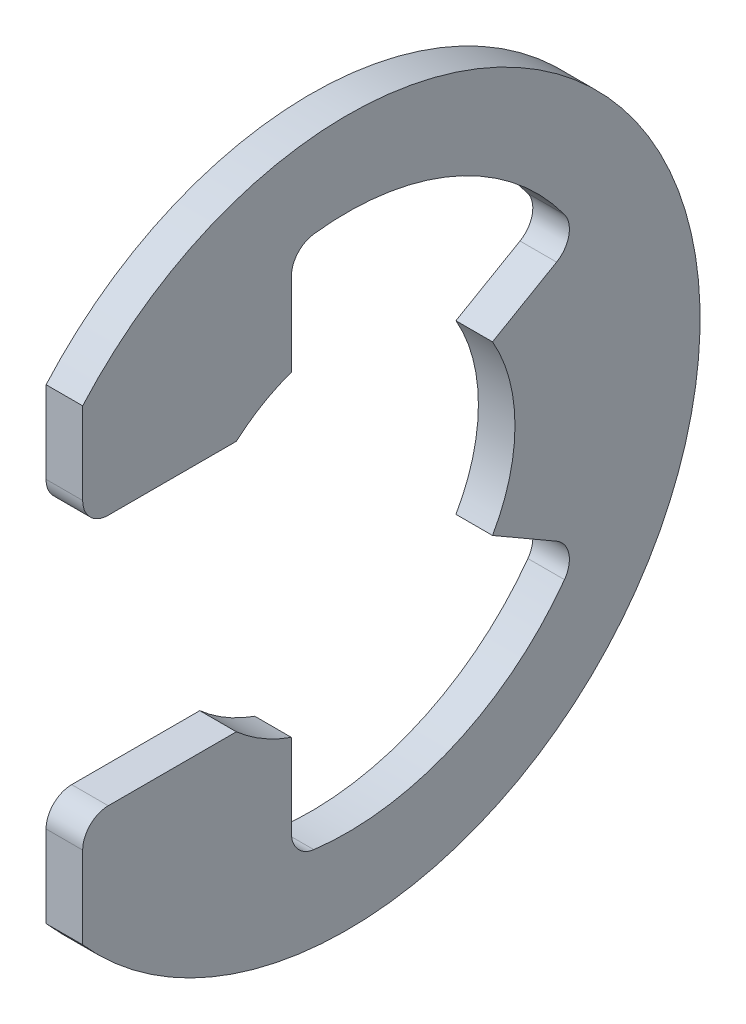
ISO-10303-21;
HEADER;
FILE_DESCRIPTION(('STEP AP214'),'2;1');
FILE_NAME('part.step','',(''),(''),'','','');
FILE_SCHEMA(('AUTOMOTIVE_DESIGN { 1 0 10303 214 1 1 1 1 }'));
ENDSEC;
DATA;
#1=APPLICATION_CONTEXT('core data for automotive mechanical design processes');
#2=APPLICATION_PROTOCOL_DEFINITION('international standard','automotive_design',2000,#1);
#3=PRODUCT_CONTEXT('',#1,'mechanical');
#4=PRODUCT('Part','Part','',(#3));
#5=PRODUCT_RELATED_PRODUCT_CATEGORY('part','',(#4));
#6=PRODUCT_DEFINITION_FORMATION('','',#4);
#7=PRODUCT_DEFINITION_CONTEXT('part definition',#1,'design');
#8=PRODUCT_DEFINITION('design','',#6,#7);
#9=PRODUCT_DEFINITION_SHAPE('','',#8);
#10=(LENGTH_UNIT() NAMED_UNIT(*) SI_UNIT(.MILLI.,.METRE.));
#11=(NAMED_UNIT(*) PLANE_ANGLE_UNIT() SI_UNIT($,.RADIAN.));
#12=(NAMED_UNIT(*) SI_UNIT($,.STERADIAN.) SOLID_ANGLE_UNIT());
#13=UNCERTAINTY_MEASURE_WITH_UNIT(LENGTH_MEASURE(1.E-05),#10,'distance_accuracy_value','');
#14=(GEOMETRIC_REPRESENTATION_CONTEXT(3) GLOBAL_UNCERTAINTY_ASSIGNED_CONTEXT((#13)) GLOBAL_UNIT_ASSIGNED_CONTEXT((#10,
#11,#12)) REPRESENTATION_CONTEXT('',''));
#15=CARTESIAN_POINT('',(0.,0.,0.));
#16=DIRECTION('',(0.,0.,1.));
#17=DIRECTION('',(1.,0.,0.));
#18=AXIS2_PLACEMENT_3D('',#15,#16,#17);
#19=CARTESIAN_POINT('',(0.5334,0.,0.));
#20=DIRECTION('',(-1.,0.,0.));
#21=DIRECTION('',(0.,0.,1.));
#22=AXIS2_PLACEMENT_3D('',#19,#20,#21);
#23=CYLINDRICAL_SURFACE('',#22,10.287);
#24=CARTESIAN_POINT('',(-0.5334,0.,0.));
#25=DIRECTION('',(1.,0.,0.));
#26=DIRECTION('',(0.,0.,-1.));
#27=AXIS2_PLACEMENT_3D('',#24,#25,#26);
#28=CIRCLE('',#27,10.287);
#29=CARTESIAN_POINT('',(-0.5334,-6.80421093423036,7.71525));
#30=VERTEX_POINT('',#29);
#31=CARTESIAN_POINT('',(-0.5334,6.80421093423036,7.71525));
#32=VERTEX_POINT('',#31);
#33=EDGE_CURVE('E194',#30,#32,#28,.T.);
#34=ORIENTED_EDGE('',*,*,#33,.T.);
#35=DIRECTION('',(-1.,0.,0.));
#36=VECTOR('',#35,1.);
#37=CARTESIAN_POINT('',(0.5334,6.80421093423036,7.71525));
#38=LINE('',#37,#36);
#39=CARTESIAN_POINT('',(0.5334,6.80421093423036,7.71525));
#40=VERTEX_POINT('',#39);
#41=EDGE_CURVE('E175',#40,#32,#38,.T.);
#42=ORIENTED_EDGE('',*,*,#41,.F.);
#43=CARTESIAN_POINT('',(0.5334,0.,0.));
#44=DIRECTION('',(1.,0.,0.));
#45=DIRECTION('',(0.,0.,-1.));
#46=AXIS2_PLACEMENT_3D('',#43,#44,#45);
#47=CIRCLE('',#46,10.287);
#48=CARTESIAN_POINT('',(0.5334,-6.80421093423036,7.71525));
#49=VERTEX_POINT('',#48);
#50=EDGE_CURVE('E181',#49,#40,#47,.T.);
#51=ORIENTED_EDGE('',*,*,#50,.F.);
#52=DIRECTION('',(-1.,0.,0.));
#53=VECTOR('',#52,1.);
#54=CARTESIAN_POINT('',(0.5334,-6.80421093423036,7.71525));
#55=LINE('',#54,#53);
#56=EDGE_CURVE('E296',#49,#30,#55,.T.);
#57=ORIENTED_EDGE('',*,*,#56,.T.);
#58=EDGE_LOOP('',(#34,#42,#51,#57));
#59=FACE_BOUND('',#58,.T.);
#60=ADVANCED_FACE('F32',(#59),#23,.T.);
#61=CARTESIAN_POINT('',(0.5334,6.80421093423036,7.71525));
#62=DIRECTION('',(0.,0.,-1.));
#63=DIRECTION('',(0.,1.,0.));
#64=AXIS2_PLACEMENT_3D('',#61,#62,#63);
#65=PLANE('',#64);
#66=DIRECTION('',(0.,-1.,0.));
#67=VECTOR('',#66,1.);
#68=CARTESIAN_POINT('',(-0.5334,6.80421093423036,7.71525));
#69=LINE('',#68,#67);
#70=CARTESIAN_POINT('',(-0.5334,4.413885,7.71525));
#71=VERTEX_POINT('',#70);
#72=EDGE_CURVE('E298',#32,#71,#69,.T.);
#73=ORIENTED_EDGE('',*,*,#72,.T.);
#74=DIRECTION('',(-1.,0.,0.));
#75=VECTOR('',#74,1.);
#76=CARTESIAN_POINT('',(0.5334,4.413885,7.71525));
#77=LINE('',#76,#75);
#78=CARTESIAN_POINT('',(0.5334,4.413885,7.71525));
#79=VERTEX_POINT('',#78);
#80=EDGE_CURVE('E178',#71,#79,#77,.F.);
#81=ORIENTED_EDGE('',*,*,#80,.T.);
#82=DIRECTION('',(0.,-1.,0.));
#83=VECTOR('',#82,1.);
#84=CARTESIAN_POINT('',(0.5334,6.80421093423036,7.71525));
#85=LINE('',#84,#83);
#86=EDGE_CURVE('E170',#40,#79,#85,.T.);
#87=ORIENTED_EDGE('',*,*,#86,.F.);
#88=ORIENTED_EDGE('',*,*,#41,.T.);
#89=EDGE_LOOP('',(#73,#81,#87,#88));
#90=FACE_BOUND('',#89,.T.);
#91=ADVANCED_FACE('F173',(#90),#65,.F.);
#92=CARTESIAN_POINT('',(0.5334,3.667125,3.23410025886258));
#93=DIRECTION('',(0.,1.,0.));
#94=DIRECTION('',(0.,0.,1.));
#95=AXIS2_PLACEMENT_3D('',#92,#93,#94);
#96=PLANE('',#95);
#97=DIRECTION('',(0.,0.,-1.));
#98=VECTOR('',#97,1.);
#99=CARTESIAN_POINT('',(0.5334,3.667125,3.23410025886258));
#100=LINE('',#99,#98);
#101=CARTESIAN_POINT('',(0.5334,3.667125,6.96849));
#102=VERTEX_POINT('',#101);
#103=CARTESIAN_POINT('',(0.5334,3.667125,3.23410025886258));
#104=VERTEX_POINT('',#103);
#105=EDGE_CURVE('E180',#102,#104,#100,.T.);
#106=ORIENTED_EDGE('',*,*,#105,.F.);
#107=DIRECTION('',(-1.,0.,0.));
#108=VECTOR('',#107,1.);
#109=CARTESIAN_POINT('',(0.5334,3.667125,6.96849));
#110=LINE('',#109,#108);
#111=CARTESIAN_POINT('',(-0.5334,3.667125,6.96849));
#112=VERTEX_POINT('',#111);
#113=EDGE_CURVE('E222',#102,#112,#110,.T.);
#114=ORIENTED_EDGE('',*,*,#113,.T.);
#115=DIRECTION('',(0.,0.,-1.));
#116=VECTOR('',#115,1.);
#117=CARTESIAN_POINT('',(-0.5334,3.667125,3.23410025886258));
#118=LINE('',#117,#116);
#119=CARTESIAN_POINT('',(-0.5334,3.667125,3.23410025886258));
#120=VERTEX_POINT('',#119);
#121=EDGE_CURVE('E300',#112,#120,#118,.T.);
#122=ORIENTED_EDGE('',*,*,#121,.T.);
#123=DIRECTION('',(-1.,0.,0.));
#124=VECTOR('',#123,1.);
#125=CARTESIAN_POINT('',(0.5334,3.667125,3.23410025886258));
#126=LINE('',#125,#124);
#127=EDGE_CURVE('E196',#104,#120,#126,.T.);
#128=ORIENTED_EDGE('',*,*,#127,.F.);
#129=EDGE_LOOP('',(#106,#114,#122,#128));
#130=FACE_BOUND('',#129,.T.);
#131=ADVANCED_FACE('F354',(#130),#96,.F.);
#132=CARTESIAN_POINT('',(0.5334,0.,0.));
#133=DIRECTION('',(-1.,0.,0.));
#134=DIRECTION('',(0.,0.,1.));
#135=AXIS2_PLACEMENT_3D('',#132,#133,#134);
#136=CYLINDRICAL_SURFACE('',#135,4.8895);
#137=CARTESIAN_POINT('',(-0.5334,0.,0.));
#138=DIRECTION('',(-1.,0.,0.));
#139=DIRECTION('',(0.,0.,1.));
#140=AXIS2_PLACEMENT_3D('',#137,#138,#139);
#141=CIRCLE('',#140,4.8895);
#142=CARTESIAN_POINT('',(-0.5334,4.6098648088155,1.62983333333333));
#143=VERTEX_POINT('',#142);
#144=EDGE_CURVE('E302',#120,#143,#141,.T.);
#145=ORIENTED_EDGE('',*,*,#144,.T.);
#146=DIRECTION('',(-1.,0.,0.));
#147=VECTOR('',#146,1.);
#148=CARTESIAN_POINT('',(0.5334,4.6098648088155,1.62983333333333));
#149=LINE('',#148,#147);
#150=CARTESIAN_POINT('',(0.5334,4.6098648088155,1.62983333333333));
#151=VERTEX_POINT('',#150);
#152=EDGE_CURVE('E202',#151,#143,#149,.T.);
#153=ORIENTED_EDGE('',*,*,#152,.F.);
#154=CARTESIAN_POINT('',(0.5334,0.,0.));
#155=DIRECTION('',(-1.,0.,0.));
#156=DIRECTION('',(0.,0.,1.));
#157=AXIS2_PLACEMENT_3D('',#154,#155,#156);
#158=CIRCLE('',#157,4.8895);
#159=EDGE_CURVE('E347',#104,#151,#158,.T.);
#160=ORIENTED_EDGE('',*,*,#159,.F.);
#161=ORIENTED_EDGE('',*,*,#127,.T.);
#162=EDGE_LOOP('',(#145,#153,#160,#161));
#163=FACE_BOUND('',#162,.T.);
#164=ADVANCED_FACE('F355',(#163),#136,.F.);
#165=CARTESIAN_POINT('',(0.5334,7.66159498155801,1.62983333333333));
#166=DIRECTION('',(0.,0.,1.));
#167=DIRECTION('',(0.,-1.,0.));
#168=AXIS2_PLACEMENT_3D('',#165,#166,#167);
#169=PLANE('',#168);
#170=DIRECTION('',(0.,1.,0.));
#171=VECTOR('',#170,1.);
#172=CARTESIAN_POINT('',(-0.5334,7.66159498155801,1.62983333333333));
#173=LINE('',#172,#171);
#174=CARTESIAN_POINT('',(-0.5334,7.03103377913734,1.62983333333333));
#175=VERTEX_POINT('',#174);
#176=EDGE_CURVE('E265',#143,#175,#173,.T.);
#177=ORIENTED_EDGE('',*,*,#176,.T.);
#178=DIRECTION('',(1.,0.,0.));
#179=VECTOR('',#178,1.);
#180=CARTESIAN_POINT('',(0.5334,7.03103377913734,1.62983333333333));
#181=LINE('',#180,#179);
#182=CARTESIAN_POINT('',(0.5334,7.03103377913734,1.62983333333333));
#183=VERTEX_POINT('',#182);
#184=EDGE_CURVE('E231',#175,#183,#181,.T.);
#185=ORIENTED_EDGE('',*,*,#184,.T.);
#186=DIRECTION('',(0.,1.,0.));
#187=VECTOR('',#186,1.);
#188=CARTESIAN_POINT('',(0.5334,7.66159498155801,1.62983333333333));
#189=LINE('',#188,#187);
#190=EDGE_CURVE('E281',#151,#183,#189,.T.);
#191=ORIENTED_EDGE('',*,*,#190,.F.);
#192=ORIENTED_EDGE('',*,*,#152,.T.);
#193=EDGE_LOOP('',(#177,#185,#191,#192));
#194=FACE_BOUND('',#193,.T.);
#195=ADVANCED_FACE('F337',(#194),#169,.F.);
#196=CARTESIAN_POINT('',(0.5334,0.,0.));
#197=DIRECTION('',(-1.,0.,0.));
#198=DIRECTION('',(0.,0.,1.));
#199=AXIS2_PLACEMENT_3D('',#196,#197,#198);
#200=CYLINDRICAL_SURFACE('',#199,7.83303225806452);
#201=CARTESIAN_POINT('',(0.5334,0.,0.));
#202=DIRECTION('',(-1.,0.,0.));
#203=DIRECTION('',(0.,0.,-1.));
#204=AXIS2_PLACEMENT_3D('',#201,#202,#203);
#205=CIRCLE('',#204,7.83303225806452);
#206=CARTESIAN_POINT('',(0.5334,7.77197268096027,0.976132676579638));
#207=VERTEX_POINT('',#206);
#208=CARTESIAN_POINT('',(0.5334,4.60957311390225,-6.33310587811927));
#209=VERTEX_POINT('',#208);
#210=EDGE_CURVE('E271',#207,#209,#205,.T.);
#211=ORIENTED_EDGE('',*,*,#210,.F.);
#212=DIRECTION('',(-1.,0.,0.));
#213=VECTOR('',#212,1.);
#214=CARTESIAN_POINT('',(0.5334,7.77197268096027,0.976132676579638));
#215=LINE('',#214,#213);
#216=CARTESIAN_POINT('',(-0.5334,7.77197268096027,0.976132676579638));
#217=VERTEX_POINT('',#216);
#218=EDGE_CURVE('E228',#207,#217,#215,.T.);
#219=ORIENTED_EDGE('',*,*,#218,.T.);
#220=CARTESIAN_POINT('',(-0.5334,0.,0.));
#221=DIRECTION('',(-1.,0.,0.));
#222=DIRECTION('',(0.,0.,-1.));
#223=AXIS2_PLACEMENT_3D('',#220,#221,#222);
#224=CIRCLE('',#223,7.83303225806452);
#225=CARTESIAN_POINT('',(-0.5334,4.60957311390225,-6.33310587811927));
#226=VERTEX_POINT('',#225);
#227=EDGE_CURVE('E254',#217,#226,#224,.T.);
#228=ORIENTED_EDGE('',*,*,#227,.T.);
#229=DIRECTION('',(-1.,0.,0.));
#230=VECTOR('',#229,1.);
#231=CARTESIAN_POINT('',(0.5334,4.60957311390225,-6.33310587811927));
#232=LINE('',#231,#230);
#233=EDGE_CURVE('E226',#226,#209,#232,.F.);
#234=ORIENTED_EDGE('',*,*,#233,.T.);
#235=EDGE_LOOP('',(#211,#219,#228,#234));
#236=FACE_BOUND('',#235,.T.);
#237=ADVANCED_FACE('F262',(#236),#200,.F.);
#238=CARTESIAN_POINT('',(0.5334,2.44475,-4.23443121180401));
#239=DIRECTION('',(0.,-0.866025403784438,-0.500000000000001));
#240=DIRECTION('',(0.,0.500000000000001,-0.866025403784438));
#241=AXIS2_PLACEMENT_3D('',#238,#239,#240);
#242=PLANE('',#241);
#243=DIRECTION('',(0.,-0.500000000000001,0.866025403784438));
#244=VECTOR('',#243,1.);
#245=CARTESIAN_POINT('',(0.5334,2.44475,-4.23443121180401));
#246=LINE('',#245,#244);
#247=CARTESIAN_POINT('',(0.5334,3.5234075842079,-6.10272095162158));
#248=VERTEX_POINT('',#247);
#249=CARTESIAN_POINT('',(0.5334,2.44475000000001,-4.23443121180401));
#250=VERTEX_POINT('',#249);
#251=EDGE_CURVE('E269',#248,#250,#246,.T.);
#252=ORIENTED_EDGE('',*,*,#251,.F.);
#253=DIRECTION('',(1.,0.,0.));
#254=VECTOR('',#253,1.);
#255=CARTESIAN_POINT('',(-0.5334,3.5234075842079,-6.10272095162158));
#256=LINE('',#255,#254);
#257=CARTESIAN_POINT('',(-0.5334,3.5234075842079,-6.10272095162158));
#258=VERTEX_POINT('',#257);
#259=EDGE_CURVE('E235',#248,#258,#256,.F.);
#260=ORIENTED_EDGE('',*,*,#259,.T.);
#261=DIRECTION('',(0.,-0.500000000000001,0.866025403784438));
#262=VECTOR('',#261,1.);
#263=CARTESIAN_POINT('',(-0.5334,2.44475,-4.23443121180401));
#264=LINE('',#263,#262);
#265=CARTESIAN_POINT('',(-0.5334,2.44475000000001,-4.23443121180401));
#266=VERTEX_POINT('',#265);
#267=EDGE_CURVE('E256',#258,#266,#264,.T.);
#268=ORIENTED_EDGE('',*,*,#267,.T.);
#269=DIRECTION('',(-1.,0.,0.));
#270=VECTOR('',#269,1.);
#271=CARTESIAN_POINT('',(0.5334,2.44475000000001,-4.23443121180401));
#272=LINE('',#271,#270);
#273=EDGE_CURVE('E275',#250,#266,#272,.T.);
#274=ORIENTED_EDGE('',*,*,#273,.F.);
#275=EDGE_LOOP('',(#252,#260,#268,#274));
#276=FACE_BOUND('',#275,.T.);
#277=ADVANCED_FACE('F273',(#276),#242,.F.);
#278=CARTESIAN_POINT('',(0.5334,0.,0.));
#279=DIRECTION('',(-1.,0.,0.));
#280=DIRECTION('',(0.,0.,1.));
#281=AXIS2_PLACEMENT_3D('',#278,#279,#280);
#282=CYLINDRICAL_SURFACE('',#281,4.8895);
#283=CARTESIAN_POINT('',(-0.5334,0.,0.));
#284=DIRECTION('',(-1.,0.,0.));
#285=DIRECTION('',(0.,0.,1.));
#286=AXIS2_PLACEMENT_3D('',#283,#284,#285);
#287=CIRCLE('',#286,4.8895);
#288=CARTESIAN_POINT('',(-0.5334,-2.44475,-4.23443121180401));
#289=VERTEX_POINT('',#288);
#290=EDGE_CURVE('E307',#266,#289,#287,.T.);
#291=ORIENTED_EDGE('',*,*,#290,.T.);
#292=DIRECTION('',(-1.,0.,0.));
#293=VECTOR('',#292,1.);
#294=CARTESIAN_POINT('',(0.5334,-2.44475,-4.23443121180401));
#295=LINE('',#294,#293);
#296=CARTESIAN_POINT('',(0.5334,-2.44475,-4.23443121180401));
#297=VERTEX_POINT('',#296);
#298=EDGE_CURVE('E329',#297,#289,#295,.T.);
#299=ORIENTED_EDGE('',*,*,#298,.F.);
#300=CARTESIAN_POINT('',(0.5334,0.,0.));
#301=DIRECTION('',(-1.,0.,0.));
#302=DIRECTION('',(0.,0.,1.));
#303=AXIS2_PLACEMENT_3D('',#300,#301,#302);
#304=CIRCLE('',#303,4.8895);
#305=EDGE_CURVE('E277',#250,#297,#304,.T.);
#306=ORIENTED_EDGE('',*,*,#305,.F.);
#307=ORIENTED_EDGE('',*,*,#273,.T.);
#308=EDGE_LOOP('',(#291,#299,#306,#307));
#309=FACE_BOUND('',#308,.T.);
#310=ADVANCED_FACE('F435',(#309),#282,.F.);
#311=CARTESIAN_POINT('',(0.5334,-2.44475,-4.23443121180401));
#312=DIRECTION('',(0.,0.866025403784438,-0.500000000000001));
#313=DIRECTION('',(0.,0.500000000000001,0.866025403784438));
#314=AXIS2_PLACEMENT_3D('',#311,#312,#313);
#315=PLANE('',#314);
#316=DIRECTION('',(0.,-0.500000000000001,-0.866025403784438));
#317=VECTOR('',#316,1.);
#318=CARTESIAN_POINT('',(-0.5334,-2.44475,-4.23443121180401));
#319=LINE('',#318,#317);
#320=CARTESIAN_POINT('',(-0.5334,-3.5234075842079,-6.10272095162158));
#321=VERTEX_POINT('',#320);
#322=EDGE_CURVE('E309',#289,#321,#319,.T.);
#323=ORIENTED_EDGE('',*,*,#322,.T.);
#324=DIRECTION('',(1.,0.,0.));
#325=VECTOR('',#324,1.);
#326=CARTESIAN_POINT('',(0.5334,-3.5234075842079,-6.10272095162158));
#327=LINE('',#326,#325);
#328=CARTESIAN_POINT('',(0.5334,-3.5234075842079,-6.10272095162158));
#329=VERTEX_POINT('',#328);
#330=EDGE_CURVE('E233',#321,#329,#327,.T.);
#331=ORIENTED_EDGE('',*,*,#330,.T.);
#332=DIRECTION('',(0.,-0.500000000000001,-0.866025403784438));
#333=VECTOR('',#332,1.);
#334=CARTESIAN_POINT('',(0.5334,-2.44475,-4.23443121180401));
#335=LINE('',#334,#333);
#336=EDGE_CURVE('E279',#297,#329,#335,.T.);
#337=ORIENTED_EDGE('',*,*,#336,.F.);
#338=ORIENTED_EDGE('',*,*,#298,.T.);
#339=EDGE_LOOP('',(#323,#331,#337,#338));
#340=FACE_BOUND('',#339,.T.);
#341=ADVANCED_FACE('F432',(#340),#315,.F.);
#342=CARTESIAN_POINT('',(0.5334,0.,0.));
#343=DIRECTION('',(-1.,0.,0.));
#344=DIRECTION('',(0.,0.,1.));
#345=AXIS2_PLACEMENT_3D('',#342,#343,#344);
#346=CYLINDRICAL_SURFACE('',#345,7.83303225806452);
#347=CARTESIAN_POINT('',(-0.5334,0.,0.));
#348=DIRECTION('',(-1.,0.,0.));
#349=DIRECTION('',(0.,0.,-1.));
#350=AXIS2_PLACEMENT_3D('',#347,#348,#349);
#351=CIRCLE('',#350,7.83303225806452);
#352=CARTESIAN_POINT('',(-0.5334,-4.60957311390224,-6.33310587811927));
#353=VERTEX_POINT('',#352);
#354=CARTESIAN_POINT('',(-0.5334,-7.77197268096027,0.976132676579636));
#355=VERTEX_POINT('',#354);
#356=EDGE_CURVE('E312',#353,#355,#351,.T.);
#357=ORIENTED_EDGE('',*,*,#356,.T.);
#358=DIRECTION('',(-1.,0.,0.));
#359=VECTOR('',#358,1.);
#360=CARTESIAN_POINT('',(0.5334,-7.77197268096027,0.976132676579636));
#361=LINE('',#360,#359);
#362=CARTESIAN_POINT('',(0.5334,-7.77197268096027,0.976132676579636));
#363=VERTEX_POINT('',#362);
#364=EDGE_CURVE('E55',#355,#363,#361,.F.);
#365=ORIENTED_EDGE('',*,*,#364,.T.);
#366=CARTESIAN_POINT('',(0.5334,0.,0.));
#367=DIRECTION('',(-1.,0.,0.));
#368=DIRECTION('',(0.,0.,-1.));
#369=AXIS2_PLACEMENT_3D('',#366,#367,#368);
#370=CIRCLE('',#369,7.83303225806452);
#371=CARTESIAN_POINT('',(0.5334,-4.60957311390224,-6.33310587811927));
#372=VERTEX_POINT('',#371);
#373=EDGE_CURVE('E287',#372,#363,#370,.T.);
#374=ORIENTED_EDGE('',*,*,#373,.F.);
#375=DIRECTION('',(-1.,0.,0.));
#376=VECTOR('',#375,1.);
#377=CARTESIAN_POINT('',(0.5334,-4.60957311390224,-6.33310587811927));
#378=LINE('',#377,#376);
#379=EDGE_CURVE('E218',#372,#353,#378,.T.);
#380=ORIENTED_EDGE('',*,*,#379,.T.);
#381=EDGE_LOOP('',(#357,#365,#374,#380));
#382=FACE_BOUND('',#381,.T.);
#383=ADVANCED_FACE('F394',(#382),#346,.F.);
#384=CARTESIAN_POINT('',(0.5334,-4.6098648088155,1.62983333333333));
#385=DIRECTION('',(0.,0.,1.));
#386=DIRECTION('',(0.,-1.,0.));
#387=AXIS2_PLACEMENT_3D('',#384,#385,#386);
#388=PLANE('',#387);
#389=DIRECTION('',(0.,1.,0.));
#390=VECTOR('',#389,1.);
#391=CARTESIAN_POINT('',(0.5334,-4.6098648088155,1.62983333333333));
#392=LINE('',#391,#390);
#393=CARTESIAN_POINT('',(0.5334,-7.03103377913734,1.62983333333333));
#394=VERTEX_POINT('',#393);
#395=CARTESIAN_POINT('',(0.5334,-4.6098648088155,1.62983333333333));
#396=VERTEX_POINT('',#395);
#397=EDGE_CURVE('E289',#394,#396,#392,.T.);
#398=ORIENTED_EDGE('',*,*,#397,.F.);
#399=DIRECTION('',(1.,0.,0.));
#400=VECTOR('',#399,1.);
#401=CARTESIAN_POINT('',(-0.5334,-7.03103377913734,1.62983333333333));
#402=LINE('',#401,#400);
#403=CARTESIAN_POINT('',(-0.5334,-7.03103377913734,1.62983333333333));
#404=VERTEX_POINT('',#403);
#405=EDGE_CURVE('E215',#394,#404,#402,.F.);
#406=ORIENTED_EDGE('',*,*,#405,.T.);
#407=DIRECTION('',(0.,1.,0.));
#408=VECTOR('',#407,1.);
#409=CARTESIAN_POINT('',(-0.5334,-4.6098648088155,1.62983333333333));
#410=LINE('',#409,#408);
#411=CARTESIAN_POINT('',(-0.5334,-4.6098648088155,1.62983333333333));
#412=VERTEX_POINT('',#411);
#413=EDGE_CURVE('E314',#404,#412,#410,.T.);
#414=ORIENTED_EDGE('',*,*,#413,.T.);
#415=DIRECTION('',(-1.,0.,0.));
#416=VECTOR('',#415,1.);
#417=CARTESIAN_POINT('',(0.5334,-4.6098648088155,1.62983333333333));
#418=LINE('',#417,#416);
#419=EDGE_CURVE('E326',#396,#412,#418,.T.);
#420=ORIENTED_EDGE('',*,*,#419,.F.);
#421=EDGE_LOOP('',(#398,#406,#414,#420));
#422=FACE_BOUND('',#421,.T.);
#423=ADVANCED_FACE('F401',(#422),#388,.F.);
#424=CARTESIAN_POINT('',(0.5334,0.,0.));
#425=DIRECTION('',(-1.,0.,0.));
#426=DIRECTION('',(0.,0.,1.));
#427=AXIS2_PLACEMENT_3D('',#424,#425,#426);
#428=CYLINDRICAL_SURFACE('',#427,4.8895);
#429=CARTESIAN_POINT('',(-0.5334,0.,0.));
#430=DIRECTION('',(-1.,0.,0.));
#431=DIRECTION('',(0.,0.,-1.));
#432=AXIS2_PLACEMENT_3D('',#429,#430,#431);
#433=CIRCLE('',#432,4.8895);
#434=CARTESIAN_POINT('',(-0.5334,-3.667125,3.23410025886258));
#435=VERTEX_POINT('',#434);
#436=EDGE_CURVE('E316',#412,#435,#433,.T.);
#437=ORIENTED_EDGE('',*,*,#436,.T.);
#438=DIRECTION('',(-1.,0.,0.));
#439=VECTOR('',#438,1.);
#440=CARTESIAN_POINT('',(0.5334,-3.667125,3.23410025886258));
#441=LINE('',#440,#439);
#442=CARTESIAN_POINT('',(0.5334,-3.667125,3.23410025886258));
#443=VERTEX_POINT('',#442);
#444=EDGE_CURVE('E323',#443,#435,#441,.T.);
#445=ORIENTED_EDGE('',*,*,#444,.F.);
#446=CARTESIAN_POINT('',(0.5334,0.,0.));
#447=DIRECTION('',(-1.,0.,0.));
#448=DIRECTION('',(0.,0.,-1.));
#449=AXIS2_PLACEMENT_3D('',#446,#447,#448);
#450=CIRCLE('',#449,4.8895);
#451=EDGE_CURVE('E291',#396,#443,#450,.T.);
#452=ORIENTED_EDGE('',*,*,#451,.F.);
#453=ORIENTED_EDGE('',*,*,#419,.T.);
#454=EDGE_LOOP('',(#437,#445,#452,#453));
#455=FACE_BOUND('',#454,.T.);
#456=ADVANCED_FACE('F408',(#455),#428,.F.);
#457=CARTESIAN_POINT('',(0.5334,-3.667125,7.71525));
#458=DIRECTION('',(0.,-1.,0.));
#459=DIRECTION('',(0.,0.,-1.));
#460=AXIS2_PLACEMENT_3D('',#457,#458,#459);
#461=PLANE('',#460);
#462=DIRECTION('',(0.,0.,1.));
#463=VECTOR('',#462,1.);
#464=CARTESIAN_POINT('',(-0.5334,-3.667125,7.71525));
#465=LINE('',#464,#463);
#466=CARTESIAN_POINT('',(-0.5334,-3.667125,6.96849));
#467=VERTEX_POINT('',#466);
#468=EDGE_CURVE('E318',#435,#467,#465,.T.);
#469=ORIENTED_EDGE('',*,*,#468,.T.);
#470=DIRECTION('',(-1.,0.,0.));
#471=VECTOR('',#470,1.);
#472=CARTESIAN_POINT('',(0.5334,-3.667125,6.96849));
#473=LINE('',#472,#471);
#474=CARTESIAN_POINT('',(0.5334,-3.667125,6.96849));
#475=VERTEX_POINT('',#474);
#476=EDGE_CURVE('E209',#467,#475,#473,.F.);
#477=ORIENTED_EDGE('',*,*,#476,.T.);
#478=DIRECTION('',(0.,0.,1.));
#479=VECTOR('',#478,1.);
#480=CARTESIAN_POINT('',(0.5334,-3.667125,7.71525));
#481=LINE('',#480,#479);
#482=EDGE_CURVE('E293',#443,#475,#481,.T.);
#483=ORIENTED_EDGE('',*,*,#482,.F.);
#484=ORIENTED_EDGE('',*,*,#444,.T.);
#485=EDGE_LOOP('',(#469,#477,#483,#484));
#486=FACE_BOUND('',#485,.T.);
#487=ADVANCED_FACE('F411',(#486),#461,.F.);
#488=CARTESIAN_POINT('',(0.5334,-6.80421093423036,7.71525));
#489=DIRECTION('',(0.,0.,-1.));
#490=DIRECTION('',(-1.,0.,0.));
#491=AXIS2_PLACEMENT_3D('',#488,#489,#490);
#492=PLANE('',#491);
#493=DIRECTION('',(0.,-1.,0.));
#494=VECTOR('',#493,1.);
#495=CARTESIAN_POINT('',(0.5334,-6.80421093423036,7.71525));
#496=LINE('',#495,#494);
#497=CARTESIAN_POINT('',(0.5334,-4.413885,7.71525));
#498=VERTEX_POINT('',#497);
#499=EDGE_CURVE('E187',#498,#49,#496,.T.);
#500=ORIENTED_EDGE('',*,*,#499,.F.);
#501=DIRECTION('',(-1.,0.,0.));
#502=VECTOR('',#501,1.);
#503=CARTESIAN_POINT('',(0.5334,-4.413885,7.71525));
#504=LINE('',#503,#502);
#505=CARTESIAN_POINT('',(-0.5334,-4.413885,7.71525));
#506=VERTEX_POINT('',#505);
#507=EDGE_CURVE('E195',#498,#506,#504,.T.);
#508=ORIENTED_EDGE('',*,*,#507,.T.);
#509=DIRECTION('',(0.,-1.,0.));
#510=VECTOR('',#509,1.);
#511=CARTESIAN_POINT('',(-0.5334,-6.80421093423036,7.71525));
#512=LINE('',#511,#510);
#513=EDGE_CURVE('E191',#506,#30,#512,.T.);
#514=ORIENTED_EDGE('',*,*,#513,.T.);
#515=ORIENTED_EDGE('',*,*,#56,.F.);
#516=EDGE_LOOP('',(#500,#508,#514,#515));
#517=FACE_BOUND('',#516,.T.);
#518=ADVANCED_FACE('F415',(#517),#492,.F.);
#519=CARTESIAN_POINT('',(0.5334,0.,0.));
#520=DIRECTION('',(1.,0.,0.));
#521=DIRECTION('',(0.,0.,-1.));
#522=AXIS2_PLACEMENT_3D('',#519,#520,#521);
#523=PLANE('',#522);
#524=ORIENTED_EDGE('',*,*,#482,.T.);
#525=CARTESIAN_POINT('',(0.5334,-4.413885,6.96849));
#526=DIRECTION('',(1.,0.,0.));
#527=DIRECTION('',(0.,0.,-1.));
#528=AXIS2_PLACEMENT_3D('',#525,#526,#527);
#529=CIRCLE('',#528,0.74676);
#530=EDGE_CURVE('E213',#475,#498,#529,.T.);
#531=ORIENTED_EDGE('',*,*,#530,.T.);
#532=ORIENTED_EDGE('',*,*,#499,.T.);
#533=ORIENTED_EDGE('',*,*,#50,.T.);
#534=ORIENTED_EDGE('',*,*,#86,.T.);
#535=CARTESIAN_POINT('',(0.5334,4.413885,6.96849));
#536=DIRECTION('',(1.,0.,0.));
#537=DIRECTION('',(0.,0.,-1.));
#538=AXIS2_PLACEMENT_3D('',#535,#536,#537);
#539=CIRCLE('',#538,0.74676);
#540=EDGE_CURVE('E211',#79,#102,#539,.T.);
#541=ORIENTED_EDGE('',*,*,#540,.T.);
#542=ORIENTED_EDGE('',*,*,#105,.T.);
#543=ORIENTED_EDGE('',*,*,#159,.T.);
#544=ORIENTED_EDGE('',*,*,#190,.T.);
#545=CARTESIAN_POINT('',(0.5334,7.03103377913734,0.883073333333332));
#546=DIRECTION('',(1.,0.,0.));
#547=DIRECTION('',(0.,0.,-1.));
#548=AXIS2_PLACEMENT_3D('',#545,#546,#547);
#549=CIRCLE('',#548,0.74676);
#550=EDGE_CURVE('E243',#183,#207,#549,.F.);
#551=ORIENTED_EDGE('',*,*,#550,.T.);
#552=ORIENTED_EDGE('',*,*,#210,.T.);
#553=CARTESIAN_POINT('',(0.5334,4.17012071473797,-5.72934095162158));
#554=DIRECTION('',(1.,0.,0.));
#555=DIRECTION('',(0.,0.,-1.));
#556=AXIS2_PLACEMENT_3D('',#553,#554,#555);
#557=CIRCLE('',#556,0.74676);
#558=EDGE_CURVE('E11',#209,#248,#557,.F.);
#559=ORIENTED_EDGE('',*,*,#558,.T.);
#560=ORIENTED_EDGE('',*,*,#251,.T.);
#561=ORIENTED_EDGE('',*,*,#305,.T.);
#562=ORIENTED_EDGE('',*,*,#336,.T.);
#563=CARTESIAN_POINT('',(0.5334,-4.17012071473797,-5.72934095162158));
#564=DIRECTION('',(1.,0.,0.));
#565=DIRECTION('',(0.,0.,-1.));
#566=AXIS2_PLACEMENT_3D('',#563,#564,#565);
#567=CIRCLE('',#566,0.74676);
#568=EDGE_CURVE('E247',#329,#372,#567,.F.);
#569=ORIENTED_EDGE('',*,*,#568,.T.);
#570=ORIENTED_EDGE('',*,*,#373,.T.);
#571=CARTESIAN_POINT('',(0.5334,-7.03103377913734,0.88307333333333));
#572=DIRECTION('',(1.,0.,0.));
#573=DIRECTION('',(0.,0.,-1.));
#574=AXIS2_PLACEMENT_3D('',#571,#572,#573);
#575=CIRCLE('',#574,0.74676);
#576=EDGE_CURVE('E47',#363,#394,#575,.F.);
#577=ORIENTED_EDGE('',*,*,#576,.T.);
#578=ORIENTED_EDGE('',*,*,#397,.T.);
#579=ORIENTED_EDGE('',*,*,#451,.T.);
#580=EDGE_LOOP('',(#524,#531,#532,#533,#534,#541,#542,#543,#544,#551,#552,#559,#560,#561,#562,
#569,#570,#577,#578,#579));
#581=FACE_BOUND('',#580,.T.);
#582=ADVANCED_FACE('F185',(#581),#523,.T.);
#583=CARTESIAN_POINT('',(-0.5334,0.,0.));
#584=DIRECTION('',(1.,0.,0.));
#585=DIRECTION('',(0.,0.,-1.));
#586=AXIS2_PLACEMENT_3D('',#583,#584,#585);
#587=PLANE('',#586);
#588=ORIENTED_EDGE('',*,*,#513,.F.);
#589=CARTESIAN_POINT('',(-0.5334,-4.413885,6.96849));
#590=DIRECTION('',(1.,0.,0.));
#591=DIRECTION('',(0.,0.,-1.));
#592=AXIS2_PLACEMENT_3D('',#589,#590,#591);
#593=CIRCLE('',#592,0.74676);
#594=EDGE_CURVE('E207',#506,#467,#593,.F.);
#595=ORIENTED_EDGE('',*,*,#594,.T.);
#596=ORIENTED_EDGE('',*,*,#468,.F.);
#597=ORIENTED_EDGE('',*,*,#436,.F.);
#598=ORIENTED_EDGE('',*,*,#413,.F.);
#599=CARTESIAN_POINT('',(-0.5334,-7.03103377913734,0.88307333333333));
#600=DIRECTION('',(1.,0.,0.));
#601=DIRECTION('',(0.,0.,-1.));
#602=AXIS2_PLACEMENT_3D('',#599,#600,#601);
#603=CIRCLE('',#602,0.74676);
#604=EDGE_CURVE('E238',#404,#355,#603,.T.);
#605=ORIENTED_EDGE('',*,*,#604,.T.);
#606=ORIENTED_EDGE('',*,*,#356,.F.);
#607=CARTESIAN_POINT('',(-0.5334,-4.17012071473797,-5.72934095162158));
#608=DIRECTION('',(1.,0.,0.));
#609=DIRECTION('',(0.,0.,-1.));
#610=AXIS2_PLACEMENT_3D('',#607,#608,#609);
#611=CIRCLE('',#610,0.74676);
#612=EDGE_CURVE('E245',#353,#321,#611,.T.);
#613=ORIENTED_EDGE('',*,*,#612,.T.);
#614=ORIENTED_EDGE('',*,*,#322,.F.);
#615=ORIENTED_EDGE('',*,*,#290,.F.);
#616=ORIENTED_EDGE('',*,*,#267,.F.);
#617=CARTESIAN_POINT('',(-0.5334,4.17012071473797,-5.72934095162158));
#618=DIRECTION('',(1.,0.,0.));
#619=DIRECTION('',(0.,0.,-1.));
#620=AXIS2_PLACEMENT_3D('',#617,#618,#619);
#621=CIRCLE('',#620,0.74676);
#622=EDGE_CURVE('E40',#258,#226,#621,.T.);
#623=ORIENTED_EDGE('',*,*,#622,.T.);
#624=ORIENTED_EDGE('',*,*,#227,.F.);
#625=CARTESIAN_POINT('',(-0.5334,7.03103377913734,0.883073333333332));
#626=DIRECTION('',(1.,0.,0.));
#627=DIRECTION('',(0.,0.,-1.));
#628=AXIS2_PLACEMENT_3D('',#625,#626,#627);
#629=CIRCLE('',#628,0.74676);
#630=EDGE_CURVE('E241',#217,#175,#629,.T.);
#631=ORIENTED_EDGE('',*,*,#630,.T.);
#632=ORIENTED_EDGE('',*,*,#176,.F.);
#633=ORIENTED_EDGE('',*,*,#144,.F.);
#634=ORIENTED_EDGE('',*,*,#121,.F.);
#635=CARTESIAN_POINT('',(-0.5334,4.413885,6.96849));
#636=DIRECTION('',(1.,0.,0.));
#637=DIRECTION('',(0.,0.,-1.));
#638=AXIS2_PLACEMENT_3D('',#635,#636,#637);
#639=CIRCLE('',#638,0.74676);
#640=EDGE_CURVE('E199',#112,#71,#639,.F.);
#641=ORIENTED_EDGE('',*,*,#640,.T.);
#642=ORIENTED_EDGE('',*,*,#72,.F.);
#643=ORIENTED_EDGE('',*,*,#33,.F.);
#644=EDGE_LOOP('',(#588,#595,#596,#597,#598,#605,#606,#613,#614,#615,#616,#623,#624,#631,#632,
#633,#634,#641,#642,#643));
#645=FACE_BOUND('',#644,.T.);
#646=ADVANCED_FACE('F253',(#645),#587,.F.);
#647=CARTESIAN_POINT('',(0.5334,-4.413885,6.96849));
#648=DIRECTION('',(-1.,0.,0.));
#649=DIRECTION('',(0.,0.,1.));
#650=AXIS2_PLACEMENT_3D('',#647,#648,#649);
#651=CYLINDRICAL_SURFACE('',#650,0.74676);
#652=ORIENTED_EDGE('',*,*,#530,.F.);
#653=ORIENTED_EDGE('',*,*,#476,.F.);
#654=ORIENTED_EDGE('',*,*,#594,.F.);
#655=ORIENTED_EDGE('',*,*,#507,.F.);
#656=EDGE_LOOP('',(#652,#653,#654,#655));
#657=FACE_BOUND('',#656,.T.);
#658=ADVANCED_FACE('F371',(#657),#651,.T.);
#659=CARTESIAN_POINT('',(0.5334,-7.03103377913734,0.88307333333333));
#660=DIRECTION('',(-1.,0.,0.));
#661=DIRECTION('',(0.,0.,1.));
#662=AXIS2_PLACEMENT_3D('',#659,#660,#661);
#663=CYLINDRICAL_SURFACE('',#662,0.74676);
#664=ORIENTED_EDGE('',*,*,#576,.F.);
#665=ORIENTED_EDGE('',*,*,#364,.F.);
#666=ORIENTED_EDGE('',*,*,#604,.F.);
#667=ORIENTED_EDGE('',*,*,#405,.F.);
#668=EDGE_LOOP('',(#664,#665,#666,#667));
#669=FACE_BOUND('',#668,.T.);
#670=ADVANCED_FACE('F374',(#669),#663,.F.);
#671=CARTESIAN_POINT('',(0.5334,4.413885,6.96849));
#672=DIRECTION('',(-1.,0.,0.));
#673=DIRECTION('',(0.,0.,1.));
#674=AXIS2_PLACEMENT_3D('',#671,#672,#673);
#675=CYLINDRICAL_SURFACE('',#674,0.74676);
#676=ORIENTED_EDGE('',*,*,#540,.F.);
#677=ORIENTED_EDGE('',*,*,#80,.F.);
#678=ORIENTED_EDGE('',*,*,#640,.F.);
#679=ORIENTED_EDGE('',*,*,#113,.F.);
#680=EDGE_LOOP('',(#676,#677,#678,#679));
#681=FACE_BOUND('',#680,.T.);
#682=ADVANCED_FACE('F378',(#681),#675,.T.);
#683=CARTESIAN_POINT('',(0.5334,7.03103377913734,0.883073333333332));
#684=DIRECTION('',(-1.,0.,0.));
#685=DIRECTION('',(0.,0.,1.));
#686=AXIS2_PLACEMENT_3D('',#683,#684,#685);
#687=CYLINDRICAL_SURFACE('',#686,0.74676);
#688=ORIENTED_EDGE('',*,*,#550,.F.);
#689=ORIENTED_EDGE('',*,*,#184,.F.);
#690=ORIENTED_EDGE('',*,*,#630,.F.);
#691=ORIENTED_EDGE('',*,*,#218,.F.);
#692=EDGE_LOOP('',(#688,#689,#690,#691));
#693=FACE_BOUND('',#692,.T.);
#694=ADVANCED_FACE('F346',(#693),#687,.F.);
#695=CARTESIAN_POINT('',(0.5334,-4.17012071473797,-5.72934095162158));
#696=DIRECTION('',(-1.,0.,0.));
#697=DIRECTION('',(0.,0.,1.));
#698=AXIS2_PLACEMENT_3D('',#695,#696,#697);
#699=CYLINDRICAL_SURFACE('',#698,0.74676);
#700=ORIENTED_EDGE('',*,*,#568,.F.);
#701=ORIENTED_EDGE('',*,*,#330,.F.);
#702=ORIENTED_EDGE('',*,*,#612,.F.);
#703=ORIENTED_EDGE('',*,*,#379,.F.);
#704=EDGE_LOOP('',(#700,#701,#702,#703));
#705=FACE_BOUND('',#704,.T.);
#706=ADVANCED_FACE('F384',(#705),#699,.F.);
#707=CARTESIAN_POINT('',(0.5334,4.17012071473797,-5.72934095162158));
#708=DIRECTION('',(-1.,0.,0.));
#709=DIRECTION('',(0.,0.,1.));
#710=AXIS2_PLACEMENT_3D('',#707,#708,#709);
#711=CYLINDRICAL_SURFACE('',#710,0.74676);
#712=ORIENTED_EDGE('',*,*,#558,.F.);
#713=ORIENTED_EDGE('',*,*,#233,.F.);
#714=ORIENTED_EDGE('',*,*,#622,.F.);
#715=ORIENTED_EDGE('',*,*,#259,.F.);
#716=EDGE_LOOP('',(#712,#713,#714,#715));
#717=FACE_BOUND('',#716,.T.);
#718=ADVANCED_FACE('F34',(#717),#711,.F.);
#719=CLOSED_SHELL('',(#60,#91,#131,#164,#195,#237,#277,#310,#341,#383,#423,#456,#487,#518,#582,
#646,#658,#670,#682,#694,#706,#718));
#720=MANIFOLD_SOLID_BREP('B2',#719);
#721=ADVANCED_BREP_SHAPE_REPRESENTATION('',(#18,#720),#14);
#722=SHAPE_DEFINITION_REPRESENTATION(#9,#721);
ENDSEC;
END-ISO-10303-21;
